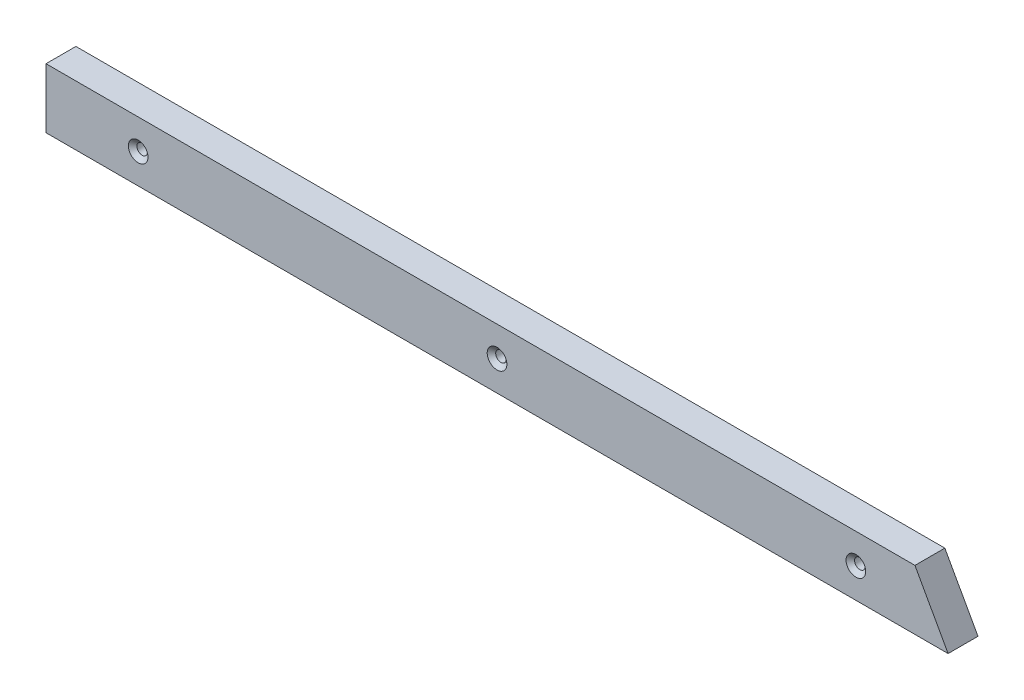
ISO-10303-21;
HEADER;
FILE_DESCRIPTION(('STEP AP214'),'2;1');
FILE_NAME('part.step','',(''),(''),'','','');
FILE_SCHEMA(('AUTOMOTIVE_DESIGN { 1 0 10303 214 1 1 1 1 }'));
ENDSEC;
DATA;
#1=APPLICATION_CONTEXT('core data for automotive mechanical design processes');
#2=APPLICATION_PROTOCOL_DEFINITION('international standard','automotive_design',2000,#1);
#3=PRODUCT_CONTEXT('',#1,'mechanical');
#4=PRODUCT('Part','Part','',(#3));
#5=PRODUCT_RELATED_PRODUCT_CATEGORY('part','',(#4));
#6=PRODUCT_DEFINITION_FORMATION('','',#4);
#7=PRODUCT_DEFINITION_CONTEXT('part definition',#1,'design');
#8=PRODUCT_DEFINITION('design','',#6,#7);
#9=PRODUCT_DEFINITION_SHAPE('','',#8);
#10=(LENGTH_UNIT() NAMED_UNIT(*) SI_UNIT(.MILLI.,.METRE.));
#11=(NAMED_UNIT(*) PLANE_ANGLE_UNIT() SI_UNIT($,.RADIAN.));
#12=(NAMED_UNIT(*) SI_UNIT($,.STERADIAN.) SOLID_ANGLE_UNIT());
#13=UNCERTAINTY_MEASURE_WITH_UNIT(LENGTH_MEASURE(1.E-05),#10,'distance_accuracy_value','');
#14=(GEOMETRIC_REPRESENTATION_CONTEXT(3) GLOBAL_UNCERTAINTY_ASSIGNED_CONTEXT((#13)) GLOBAL_UNIT_ASSIGNED_CONTEXT((#10,
#11,#12)) REPRESENTATION_CONTEXT('',''));
#15=CARTESIAN_POINT('',(0.,0.,0.));
#16=DIRECTION('',(0.,0.,1.));
#17=DIRECTION('',(1.,0.,0.));
#18=AXIS2_PLACEMENT_3D('',#15,#16,#17);
#19=CARTESIAN_POINT('',(58.7375,19.05,19.0499999999929));
#20=DIRECTION('',(0.,0.,1.));
#21=DIRECTION('',(1.,0.,0.));
#22=AXIS2_PLACEMENT_3D('',#19,#20,#21);
#23=CONICAL_SURFACE('',#22,6.26109999991085,0.855211333477975);
#24=CARTESIAN_POINT('',(58.7375,19.05,16.5328933219806));
#25=DIRECTION('',(0.,0.,-1.));
#26=DIRECTION('',(-1.,0.,0.));
#27=AXIS2_PLACEMENT_3D('',#24,#25,#26);
#28=CIRCLE('',#27,3.3655);
#29=CARTESIAN_POINT('',(55.372,19.05,16.5328933219806));
#30=VERTEX_POINT('',#29);
#31=EDGE_CURVE('E99',#30,#30,#28,.T.);
#32=ORIENTED_EDGE('',*,*,#31,.T.);
#33=EDGE_LOOP('',(#32));
#34=FACE_BOUND('',#33,.T.);
#35=CARTESIAN_POINT('',(58.7375,19.05,19.0500000000856));
#36=DIRECTION('',(0.,0.,1.));
#37=DIRECTION('',(1.,0.,0.));
#38=AXIS2_PLACEMENT_3D('',#35,#36,#37);
#39=CIRCLE('',#38,6.26110000001745);
#40=CARTESIAN_POINT('',(64.9986000000174,19.05,19.0500000000856));
#41=VERTEX_POINT('',#40);
#42=EDGE_CURVE('E20',#41,#41,#39,.F.);
#43=ORIENTED_EDGE('',*,*,#42,.F.);
#44=EDGE_LOOP('',(#43));
#45=FACE_BOUND('',#44,.T.);
#46=ADVANCED_FACE('F17',(#34,#45),#23,.F.);
#47=CARTESIAN_POINT('',(287.3375,19.05,19.0499999999929));
#48=DIRECTION('',(0.,0.,1.));
#49=DIRECTION('',(1.,0.,0.));
#50=AXIS2_PLACEMENT_3D('',#47,#48,#49);
#51=CONICAL_SURFACE('',#50,6.26109999991085,0.855211333477975);
#52=CARTESIAN_POINT('',(287.3375,19.05,16.5328933219781));
#53=DIRECTION('',(0.,0.,-1.));
#54=DIRECTION('',(-1.,0.,0.));
#55=AXIS2_PLACEMENT_3D('',#52,#53,#54);
#56=CIRCLE('',#55,3.3655);
#57=CARTESIAN_POINT('',(283.972,19.05,16.5328933219781));
#58=VERTEX_POINT('',#57);
#59=EDGE_CURVE('E96',#58,#58,#56,.T.);
#60=ORIENTED_EDGE('',*,*,#59,.T.);
#61=EDGE_LOOP('',(#60));
#62=FACE_BOUND('',#61,.T.);
#63=CARTESIAN_POINT('',(287.3375,19.05,19.050000000135));
#64=DIRECTION('',(0.,0.,1.));
#65=DIRECTION('',(1.,0.,0.));
#66=AXIS2_PLACEMENT_3D('',#63,#64,#65);
#67=CIRCLE('',#66,6.26110000007429);
#68=CARTESIAN_POINT('',(293.598600000074,19.05,19.050000000135));
#69=VERTEX_POINT('',#68);
#70=EDGE_CURVE('E110',#69,#69,#67,.F.);
#71=ORIENTED_EDGE('',*,*,#70,.F.);
#72=EDGE_LOOP('',(#71));
#73=FACE_BOUND('',#72,.T.);
#74=ADVANCED_FACE('F119',(#62,#73),#51,.F.);
#75=CARTESIAN_POINT('',(515.9375,19.05,19.0499999999929));
#76=DIRECTION('',(0.,0.,1.));
#77=DIRECTION('',(1.,0.,0.));
#78=AXIS2_PLACEMENT_3D('',#75,#76,#77);
#79=CONICAL_SURFACE('',#78,6.26109999991085,0.855211333477975);
#80=CARTESIAN_POINT('',(515.9375,19.05,16.5328933219781));
#81=DIRECTION('',(0.,0.,-1.));
#82=DIRECTION('',(-1.,0.,0.));
#83=AXIS2_PLACEMENT_3D('',#80,#81,#82);
#84=CIRCLE('',#83,3.3655);
#85=CARTESIAN_POINT('',(512.572,19.05,16.5328933219781));
#86=VERTEX_POINT('',#85);
#87=EDGE_CURVE('E76',#86,#86,#84,.T.);
#88=ORIENTED_EDGE('',*,*,#87,.T.);
#89=EDGE_LOOP('',(#88));
#90=FACE_BOUND('',#89,.T.);
#91=CARTESIAN_POINT('',(515.9375,19.05,19.0500000000856));
#92=DIRECTION('',(0.,0.,1.));
#93=DIRECTION('',(1.,0.,0.));
#94=AXIS2_PLACEMENT_3D('',#91,#92,#93);
#95=CIRCLE('',#94,6.26110000001745);
#96=CARTESIAN_POINT('',(522.198600000017,19.05,19.0500000000856));
#97=VERTEX_POINT('',#96);
#98=EDGE_CURVE('E101',#97,#97,#95,.F.);
#99=ORIENTED_EDGE('',*,*,#98,.F.);
#100=EDGE_LOOP('',(#99));
#101=FACE_BOUND('',#100,.T.);
#102=ADVANCED_FACE('F125',(#90,#101),#79,.F.);
#103=CARTESIAN_POINT('',(0.,0.,19.05));
#104=DIRECTION('',(0.,0.,1.));
#105=DIRECTION('',(1.,0.,0.));
#106=AXIS2_PLACEMENT_3D('',#103,#104,#105);
#107=PLANE('',#106);
#108=ORIENTED_EDGE('',*,*,#98,.T.);
#109=EDGE_LOOP('',(#108));
#110=FACE_BOUND('',#109,.T.);
#111=ORIENTED_EDGE('',*,*,#70,.T.);
#112=EDGE_LOOP('',(#111));
#113=FACE_BOUND('',#112,.T.);
#114=ORIENTED_EDGE('',*,*,#42,.T.);
#115=EDGE_LOOP('',(#114));
#116=FACE_BOUND('',#115,.T.);
#117=DIRECTION('',(0.,1.,0.));
#118=VECTOR('',#117,1.);
#119=CARTESIAN_POINT('',(0.,38.1,19.05));
#120=LINE('',#119,#118);
#121=CARTESIAN_POINT('',(0.,0.,19.05));
#122=VERTEX_POINT('',#121);
#123=CARTESIAN_POINT('',(0.,38.1,19.05));
#124=VERTEX_POINT('',#123);
#125=EDGE_CURVE('E72',#122,#124,#120,.T.);
#126=ORIENTED_EDGE('',*,*,#125,.F.);
#127=DIRECTION('',(1.,0.,0.));
#128=VECTOR('',#127,1.);
#129=CARTESIAN_POINT('',(0.,0.,19.05));
#130=LINE('',#129,#128);
#131=CARTESIAN_POINT('',(574.675,0.,19.05));
#132=VERTEX_POINT('',#131);
#133=EDGE_CURVE('E68',#132,#122,#130,.F.);
#134=ORIENTED_EDGE('',*,*,#133,.F.);
#135=DIRECTION('',(-0.484809620246307,0.874619707139413,0.));
#136=VECTOR('',#135,1.);
#137=CARTESIAN_POINT('',(574.675,0.,19.05));
#138=LINE('',#137,#136);
#139=CARTESIAN_POINT('',(553.555825139632,38.1000000000025,19.05));
#140=VERTEX_POINT('',#139);
#141=EDGE_CURVE('E59',#140,#132,#138,.F.);
#142=ORIENTED_EDGE('',*,*,#141,.F.);
#143=DIRECTION('',(1.,0.,0.));
#144=VECTOR('',#143,1.);
#145=CARTESIAN_POINT('',(553.555825139628,38.1,19.05));
#146=LINE('',#145,#144);
#147=EDGE_CURVE('E54',#124,#140,#146,.T.);
#148=ORIENTED_EDGE('',*,*,#147,.F.);
#149=EDGE_LOOP('',(#126,#134,#142,#148));
#150=FACE_BOUND('',#149,.T.);
#151=ADVANCED_FACE('F71',(#110,#113,#116,#150),#107,.T.);
#152=CARTESIAN_POINT('',(58.7375,19.05,22.0027501654277));
#153=DIRECTION('',(0.,0.,-1.));
#154=DIRECTION('',(-1.,0.,0.));
#155=AXIS2_PLACEMENT_3D('',#152,#153,#154);
#156=CYLINDRICAL_SURFACE('',#155,3.3655);
#157=CARTESIAN_POINT('',(58.7375,19.05,3.31639708122111));
#158=DIRECTION('',(0.,0.,-1.));
#159=DIRECTION('',(1.,0.,0.));
#160=AXIS2_PLACEMENT_3D('',#157,#158,#159);
#161=CIRCLE('',#160,3.36549999997915);
#162=CARTESIAN_POINT('',(62.1029999999791,19.05,3.31639708122111));
#163=VERTEX_POINT('',#162);
#164=EDGE_CURVE('E91',#163,#163,#161,.T.);
#165=ORIENTED_EDGE('',*,*,#164,.T.);
#166=EDGE_LOOP('',(#165));
#167=FACE_BOUND('',#166,.T.);
#168=ORIENTED_EDGE('',*,*,#31,.F.);
#169=EDGE_LOOP('',(#168));
#170=FACE_BOUND('',#169,.T.);
#171=ADVANCED_FACE('F165',(#167,#170),#156,.F.);
#172=CARTESIAN_POINT('',(287.3375,19.05,22.0027500078765));
#173=DIRECTION('',(0.,0.,-1.));
#174=DIRECTION('',(-1.,0.,0.));
#175=AXIS2_PLACEMENT_3D('',#172,#173,#174);
#176=CYLINDRICAL_SURFACE('',#175,3.3655);
#177=CARTESIAN_POINT('',(287.3375,19.05,3.31639708116427));
#178=DIRECTION('',(0.,0.,-1.));
#179=DIRECTION('',(1.,0.,0.));
#180=AXIS2_PLACEMENT_3D('',#177,#178,#179);
#181=CIRCLE('',#180,3.36550000012142);
#182=CARTESIAN_POINT('',(290.703000000121,19.05,3.31639708116427));
#183=VERTEX_POINT('',#182);
#184=EDGE_CURVE('E88',#183,#183,#181,.T.);
#185=ORIENTED_EDGE('',*,*,#184,.T.);
#186=EDGE_LOOP('',(#185));
#187=FACE_BOUND('',#186,.T.);
#188=ORIENTED_EDGE('',*,*,#59,.F.);
#189=EDGE_LOOP('',(#188));
#190=FACE_BOUND('',#189,.T.);
#191=ADVANCED_FACE('F161',(#187,#190),#176,.F.);
#192=CARTESIAN_POINT('',(515.9375,19.05,22.00275));
#193=DIRECTION('',(0.,0.,-1.));
#194=DIRECTION('',(-1.,0.,0.));
#195=AXIS2_PLACEMENT_3D('',#192,#193,#194);
#196=CYLINDRICAL_SURFACE('',#195,3.3655);
#197=CARTESIAN_POINT('',(515.9375,19.05,3.31639708116427));
#198=DIRECTION('',(0.,0.,-1.));
#199=DIRECTION('',(1.,0.,0.));
#200=AXIS2_PLACEMENT_3D('',#197,#198,#199);
#201=CIRCLE('',#200,3.36550000009317);
#202=CARTESIAN_POINT('',(519.303000000093,19.05,3.31639708116427));
#203=VERTEX_POINT('',#202);
#204=EDGE_CURVE('E85',#203,#203,#201,.T.);
#205=ORIENTED_EDGE('',*,*,#204,.T.);
#206=EDGE_LOOP('',(#205));
#207=FACE_BOUND('',#206,.T.);
#208=ORIENTED_EDGE('',*,*,#87,.F.);
#209=EDGE_LOOP('',(#208));
#210=FACE_BOUND('',#209,.T.);
#211=ADVANCED_FACE('F158',(#207,#210),#196,.F.);
#212=CARTESIAN_POINT('',(0.,0.,0.));
#213=DIRECTION('',(0.,-1.,0.));
#214=DIRECTION('',(0.,0.,-1.));
#215=AXIS2_PLACEMENT_3D('',#212,#213,#214);
#216=PLANE('',#215);
#217=DIRECTION('',(0.,0.,1.));
#218=VECTOR('',#217,1.);
#219=CARTESIAN_POINT('',(0.,0.,0.));
#220=LINE('',#219,#218);
#221=CARTESIAN_POINT('',(0.,0.,0.));
#222=VERTEX_POINT('',#221);
#223=EDGE_CURVE('E290',#222,#122,#220,.T.);
#224=ORIENTED_EDGE('',*,*,#223,.F.);
#225=DIRECTION('',(1.,0.,0.));
#226=VECTOR('',#225,1.);
#227=CARTESIAN_POINT('',(0.,0.,0.));
#228=LINE('',#227,#226);
#229=CARTESIAN_POINT('',(574.675,0.,0.));
#230=VERTEX_POINT('',#229);
#231=EDGE_CURVE('E80',#222,#230,#228,.T.);
#232=ORIENTED_EDGE('',*,*,#231,.T.);
#233=DIRECTION('',(0.,0.,1.));
#234=VECTOR('',#233,1.);
#235=CARTESIAN_POINT('',(574.675,0.,0.));
#236=LINE('',#235,#234);
#237=EDGE_CURVE('E64',#132,#230,#236,.F.);
#238=ORIENTED_EDGE('',*,*,#237,.F.);
#239=ORIENTED_EDGE('',*,*,#133,.T.);
#240=EDGE_LOOP('',(#224,#232,#238,#239));
#241=FACE_BOUND('',#240,.T.);
#242=ADVANCED_FACE('F79',(#241),#216,.T.);
#243=CARTESIAN_POINT('',(574.675,0.,0.));
#244=DIRECTION('',(0.874619707139413,0.484809620246307,0.));
#245=DIRECTION('',(-0.484809620246307,0.874619707139413,0.));
#246=AXIS2_PLACEMENT_3D('',#243,#244,#245);
#247=PLANE('',#246);
#248=ORIENTED_EDGE('',*,*,#237,.T.);
#249=DIRECTION('',(-0.484809620246714,0.874619707139187,0.));
#250=VECTOR('',#249,1.);
#251=CARTESIAN_POINT('',(574.675,0.,0.));
#252=LINE('',#251,#250);
#253=CARTESIAN_POINT('',(553.555825139637,38.1000000000049,0.));
#254=VERTEX_POINT('',#253);
#255=EDGE_CURVE('E282',#230,#254,#252,.T.);
#256=ORIENTED_EDGE('',*,*,#255,.T.);
#257=DIRECTION('',(0.,0.,1.));
#258=VECTOR('',#257,1.);
#259=CARTESIAN_POINT('',(553.555825139628,38.1,0.));
#260=LINE('',#259,#258);
#261=EDGE_CURVE('E66',#140,#254,#260,.F.);
#262=ORIENTED_EDGE('',*,*,#261,.F.);
#263=ORIENTED_EDGE('',*,*,#141,.T.);
#264=EDGE_LOOP('',(#248,#256,#262,#263));
#265=FACE_BOUND('',#264,.T.);
#266=ADVANCED_FACE('F61',(#265),#247,.T.);
#267=CARTESIAN_POINT('',(553.555825139628,38.1,0.));
#268=DIRECTION('',(0.,1.,0.));
#269=DIRECTION('',(0.,0.,1.));
#270=AXIS2_PLACEMENT_3D('',#267,#268,#269);
#271=PLANE('',#270);
#272=ORIENTED_EDGE('',*,*,#261,.T.);
#273=DIRECTION('',(1.,0.,0.));
#274=VECTOR('',#273,1.);
#275=CARTESIAN_POINT('',(0.,38.1,0.));
#276=LINE('',#275,#274);
#277=CARTESIAN_POINT('',(0.,38.1,0.));
#278=VERTEX_POINT('',#277);
#279=EDGE_CURVE('E281',#254,#278,#276,.F.);
#280=ORIENTED_EDGE('',*,*,#279,.T.);
#281=DIRECTION('',(0.,0.,1.));
#282=VECTOR('',#281,1.);
#283=CARTESIAN_POINT('',(0.,38.1,0.));
#284=LINE('',#283,#282);
#285=EDGE_CURVE('E35',#124,#278,#284,.F.);
#286=ORIENTED_EDGE('',*,*,#285,.F.);
#287=ORIENTED_EDGE('',*,*,#147,.T.);
#288=EDGE_LOOP('',(#272,#280,#286,#287));
#289=FACE_BOUND('',#288,.T.);
#290=ADVANCED_FACE('F151',(#289),#271,.T.);
#291=CARTESIAN_POINT('',(0.,38.1,0.));
#292=DIRECTION('',(-1.,0.,0.));
#293=DIRECTION('',(0.,0.,1.));
#294=AXIS2_PLACEMENT_3D('',#291,#292,#293);
#295=PLANE('',#294);
#296=ORIENTED_EDGE('',*,*,#285,.T.);
#297=DIRECTION('',(0.,1.,0.));
#298=VECTOR('',#297,1.);
#299=CARTESIAN_POINT('',(0.,0.,0.));
#300=LINE('',#299,#298);
#301=EDGE_CURVE('E108',#278,#222,#300,.F.);
#302=ORIENTED_EDGE('',*,*,#301,.T.);
#303=ORIENTED_EDGE('',*,*,#223,.T.);
#304=ORIENTED_EDGE('',*,*,#125,.T.);
#305=EDGE_LOOP('',(#296,#302,#303,#304));
#306=FACE_BOUND('',#305,.T.);
#307=ADVANCED_FACE('F147',(#306),#295,.T.);
#308=CARTESIAN_POINT('',(58.7375,19.05,2.27373675443232E-10));
#309=DIRECTION('',(0.,0.,-1.));
#310=DIRECTION('',(-1.,0.,0.));
#311=AXIS2_PLACEMENT_3D('',#308,#309,#310);
#312=CONICAL_SURFACE('',#311,6.24839999984006,0.71558499331528);
#313=ORIENTED_EDGE('',*,*,#164,.F.);
#314=EDGE_LOOP('',(#313));
#315=FACE_BOUND('',#314,.T.);
#316=CARTESIAN_POINT('',(58.7375,19.05,5.6843418860808E-11));
#317=DIRECTION('',(0.,0.,-1.));
#318=DIRECTION('',(-1.,0.,0.));
#319=AXIS2_PLACEMENT_3D('',#316,#317,#318);
#320=CIRCLE('',#319,6.2483999999883);
#321=CARTESIAN_POINT('',(52.4891000000117,19.05,5.6843418860808E-11));
#322=VERTEX_POINT('',#321);
#323=EDGE_CURVE('E105',#322,#322,#320,.T.);
#324=ORIENTED_EDGE('',*,*,#323,.T.);
#325=EDGE_LOOP('',(#324));
#326=FACE_BOUND('',#325,.T.);
#327=ADVANCED_FACE('F143',(#315,#326),#312,.F.);
#328=CARTESIAN_POINT('',(287.3375,19.05,2.27373675443232E-10));
#329=DIRECTION('',(0.,0.,-1.));
#330=DIRECTION('',(-1.,0.,0.));
#331=AXIS2_PLACEMENT_3D('',#328,#329,#330);
#332=CONICAL_SURFACE('',#331,6.24839999986865,0.715584993314004);
#333=ORIENTED_EDGE('',*,*,#184,.F.);
#334=EDGE_LOOP('',(#333));
#335=FACE_BOUND('',#334,.T.);
#336=CARTESIAN_POINT('',(287.3375,19.05,5.6843418860808E-11));
#337=DIRECTION('',(0.,0.,-1.));
#338=DIRECTION('',(-1.,0.,0.));
#339=AXIS2_PLACEMENT_3D('',#336,#337,#338);
#340=CIRCLE('',#339,6.24840000001689);
#341=CARTESIAN_POINT('',(281.089099999983,19.05,5.6843418860808E-11));
#342=VERTEX_POINT('',#341);
#343=EDGE_CURVE('E26',#342,#342,#340,.T.);
#344=ORIENTED_EDGE('',*,*,#343,.T.);
#345=EDGE_LOOP('',(#344));
#346=FACE_BOUND('',#345,.T.);
#347=ADVANCED_FACE('F135',(#335,#346),#332,.F.);
#348=CARTESIAN_POINT('',(515.9375,19.05,2.27373675443232E-10));
#349=DIRECTION('',(0.,0.,-1.));
#350=DIRECTION('',(-1.,0.,0.));
#351=AXIS2_PLACEMENT_3D('',#348,#349,#350);
#352=CONICAL_SURFACE('',#351,6.24839999984039,0.715584993314004);
#353=ORIENTED_EDGE('',*,*,#204,.F.);
#354=EDGE_LOOP('',(#353));
#355=FACE_BOUND('',#354,.T.);
#356=CARTESIAN_POINT('',(515.9375,19.05,5.6843418860808E-11));
#357=DIRECTION('',(0.,0.,-1.));
#358=DIRECTION('',(-1.,0.,0.));
#359=AXIS2_PLACEMENT_3D('',#356,#357,#358);
#360=CIRCLE('',#359,6.24839999998863);
#361=CARTESIAN_POINT('',(509.689100000011,19.05,5.6843418860808E-11));
#362=VERTEX_POINT('',#361);
#363=EDGE_CURVE('E11',#362,#362,#360,.T.);
#364=ORIENTED_EDGE('',*,*,#363,.T.);
#365=EDGE_LOOP('',(#364));
#366=FACE_BOUND('',#365,.T.);
#367=ADVANCED_FACE('F129',(#355,#366),#352,.F.);
#368=CARTESIAN_POINT('',(0.,0.,0.));
#369=DIRECTION('',(0.,0.,1.));
#370=DIRECTION('',(1.,0.,0.));
#371=AXIS2_PLACEMENT_3D('',#368,#369,#370);
#372=PLANE('',#371);
#373=ORIENTED_EDGE('',*,*,#363,.F.);
#374=EDGE_LOOP('',(#373));
#375=FACE_BOUND('',#374,.T.);
#376=ORIENTED_EDGE('',*,*,#343,.F.);
#377=EDGE_LOOP('',(#376));
#378=FACE_BOUND('',#377,.T.);
#379=ORIENTED_EDGE('',*,*,#323,.F.);
#380=EDGE_LOOP('',(#379));
#381=FACE_BOUND('',#380,.T.);
#382=ORIENTED_EDGE('',*,*,#279,.F.);
#383=ORIENTED_EDGE('',*,*,#255,.F.);
#384=ORIENTED_EDGE('',*,*,#231,.F.);
#385=ORIENTED_EDGE('',*,*,#301,.F.);
#386=EDGE_LOOP('',(#382,#383,#384,#385));
#387=FACE_BOUND('',#386,.T.);
#388=ADVANCED_FACE('F127',(#375,#378,#381,#387),#372,.F.);
#389=CLOSED_SHELL('',(#46,#74,#102,#151,#171,#191,#211,#242,#266,#290,#307,#327,#347,#367,#388));
#390=MANIFOLD_SOLID_BREP('B1',#389);
#391=ADVANCED_BREP_SHAPE_REPRESENTATION('',(#18,#390),#14);
#392=SHAPE_DEFINITION_REPRESENTATION(#9,#391);
ENDSEC;
END-ISO-10303-21;
